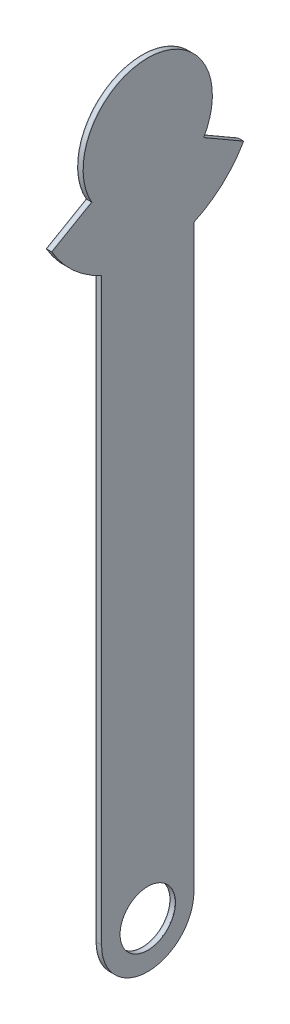
ISO-10303-21;
HEADER;
FILE_DESCRIPTION(('STEP AP214'),'2;1');
FILE_NAME('part.step','',(''),(''),'','','');
FILE_SCHEMA(('AUTOMOTIVE_DESIGN { 1 0 10303 214 1 1 1 1 }'));
ENDSEC;
DATA;
#1=APPLICATION_CONTEXT('core data for automotive mechanical design processes');
#2=APPLICATION_PROTOCOL_DEFINITION('international standard','automotive_design',2000,#1);
#3=PRODUCT_CONTEXT('',#1,'mechanical');
#4=PRODUCT('Part','Part','',(#3));
#5=PRODUCT_RELATED_PRODUCT_CATEGORY('part','',(#4));
#6=PRODUCT_DEFINITION_FORMATION('','',#4);
#7=PRODUCT_DEFINITION_CONTEXT('part definition',#1,'design');
#8=PRODUCT_DEFINITION('design','',#6,#7);
#9=PRODUCT_DEFINITION_SHAPE('','',#8);
#10=(LENGTH_UNIT() NAMED_UNIT(*) SI_UNIT(.MILLI.,.METRE.));
#11=(NAMED_UNIT(*) PLANE_ANGLE_UNIT() SI_UNIT($,.RADIAN.));
#12=(NAMED_UNIT(*) SI_UNIT($,.STERADIAN.) SOLID_ANGLE_UNIT());
#13=UNCERTAINTY_MEASURE_WITH_UNIT(LENGTH_MEASURE(1.E-05),#10,'distance_accuracy_value','');
#14=(GEOMETRIC_REPRESENTATION_CONTEXT(3) GLOBAL_UNCERTAINTY_ASSIGNED_CONTEXT((#13)) GLOBAL_UNIT_ASSIGNED_CONTEXT((#10,
#11,#12)) REPRESENTATION_CONTEXT('',''));
#15=CARTESIAN_POINT('',(0.,0.,0.));
#16=DIRECTION('',(0.,0.,1.));
#17=DIRECTION('',(1.,0.,0.));
#18=AXIS2_PLACEMENT_3D('',#15,#16,#17);
#19=CARTESIAN_POINT('',(-2.75,196.8,0.));
#20=DIRECTION('',(1.,0.,0.));
#21=DIRECTION('',(0.,0.,-1.));
#22=AXIS2_PLACEMENT_3D('',#19,#20,#21);
#23=CYLINDRICAL_SURFACE('',#22,60.);
#24=CARTESIAN_POINT('',(-2.5,196.8,0.));
#25=DIRECTION('',(-1.,0.,0.));
#26=DIRECTION('',(0.,0.,1.));
#27=AXIS2_PLACEMENT_3D('',#24,#25,#26);
#28=CIRCLE('',#27,60.);
#29=CARTESIAN_POINT('',(-2.5,142.256439426821,25.));
#30=VERTEX_POINT('',#29);
#31=CARTESIAN_POINT('',(-2.5,166.8,51.9615242270665));
#32=VERTEX_POINT('',#31);
#33=EDGE_CURVE('E165',#30,#32,#28,.T.);
#34=ORIENTED_EDGE('',*,*,#33,.T.);
#35=DIRECTION('',(1.,0.,0.));
#36=VECTOR('',#35,1.);
#37=CARTESIAN_POINT('',(-2.75,166.8,51.9615242270665));
#38=LINE('',#37,#36);
#39=CARTESIAN_POINT('',(-2.75,166.8,51.9615242270665));
#40=VERTEX_POINT('',#39);
#41=EDGE_CURVE('E12',#40,#32,#38,.T.);
#42=ORIENTED_EDGE('',*,*,#41,.F.);
#43=CARTESIAN_POINT('',(-2.75,196.8,0.));
#44=DIRECTION('',(-1.,0.,0.));
#45=DIRECTION('',(0.,0.,1.));
#46=AXIS2_PLACEMENT_3D('',#43,#44,#45);
#47=CIRCLE('',#46,60.);
#48=CARTESIAN_POINT('',(-2.75,142.256439426821,25.));
#49=VERTEX_POINT('',#48);
#50=EDGE_CURVE('E231',#49,#40,#47,.T.);
#51=ORIENTED_EDGE('',*,*,#50,.F.);
#52=DIRECTION('',(1.,0.,0.));
#53=VECTOR('',#52,1.);
#54=CARTESIAN_POINT('',(-2.75,142.256439426821,25.));
#55=LINE('',#54,#53);
#56=EDGE_CURVE('E157',#49,#30,#55,.T.);
#57=ORIENTED_EDGE('',*,*,#56,.T.);
#58=EDGE_LOOP('',(#34,#42,#51,#57));
#59=FACE_BOUND('',#58,.T.);
#60=ADVANCED_FACE('F58',(#59),#23,.T.);
#61=CARTESIAN_POINT('',(-2.75,147.600000000001,85.2168997323883));
#62=DIRECTION('',(0.,-0.866025403784441,-0.499999999999995));
#63=DIRECTION('',(0.,0.499999999999995,-0.866025403784442));
#64=AXIS2_PLACEMENT_3D('',#61,#62,#63);
#65=PLANE('',#64);
#66=DIRECTION('',(0.,0.499999999999995,-0.866025403784442));
#67=VECTOR('',#66,1.);
#68=CARTESIAN_POINT('',(-2.5,147.600000000001,85.2168997323883));
#69=LINE('',#68,#67);
#70=CARTESIAN_POINT('',(-2.5,179.3,30.3108891324555));
#71=VERTEX_POINT('',#70);
#72=EDGE_CURVE('E169',#32,#71,#69,.T.);
#73=ORIENTED_EDGE('',*,*,#72,.T.);
#74=DIRECTION('',(1.,0.,0.));
#75=VECTOR('',#74,1.);
#76=CARTESIAN_POINT('',(-2.75,179.3,30.3108891324555));
#77=LINE('',#76,#75);
#78=CARTESIAN_POINT('',(-2.75,179.3,30.3108891324555));
#79=VERTEX_POINT('',#78);
#80=EDGE_CURVE('E68',#79,#71,#77,.T.);
#81=ORIENTED_EDGE('',*,*,#80,.F.);
#82=DIRECTION('',(0.,0.499999999999995,-0.866025403784442));
#83=VECTOR('',#82,1.);
#84=CARTESIAN_POINT('',(-2.75,147.600000000001,85.2168997323883));
#85=LINE('',#84,#83);
#86=EDGE_CURVE('E119',#40,#79,#85,.T.);
#87=ORIENTED_EDGE('',*,*,#86,.F.);
#88=ORIENTED_EDGE('',*,*,#41,.T.);
#89=EDGE_LOOP('',(#73,#81,#87,#88));
#90=FACE_BOUND('',#89,.T.);
#91=ADVANCED_FACE('F253',(#90),#65,.F.);
#92=CARTESIAN_POINT('',(-2.75,196.8,0.));
#93=DIRECTION('',(1.,0.,0.));
#94=DIRECTION('',(0.,0.,-1.));
#95=AXIS2_PLACEMENT_3D('',#92,#93,#94);
#96=CYLINDRICAL_SURFACE('',#95,35.);
#97=CARTESIAN_POINT('',(-2.5,196.8,0.));
#98=DIRECTION('',(-1.,0.,0.));
#99=DIRECTION('',(0.,0.,1.));
#100=AXIS2_PLACEMENT_3D('',#97,#98,#99);
#101=CIRCLE('',#100,35.);
#102=CARTESIAN_POINT('',(-2.5,179.3,-30.3108891324553));
#103=VERTEX_POINT('',#102);
#104=EDGE_CURVE('E172',#71,#103,#101,.T.);
#105=ORIENTED_EDGE('',*,*,#104,.T.);
#106=DIRECTION('',(1.,0.,0.));
#107=VECTOR('',#106,1.);
#108=CARTESIAN_POINT('',(-2.75,179.3,-30.3108891324553));
#109=LINE('',#108,#107);
#110=CARTESIAN_POINT('',(-2.75,179.3,-30.3108891324553));
#111=VERTEX_POINT('',#110);
#112=EDGE_CURVE('E198',#111,#103,#109,.T.);
#113=ORIENTED_EDGE('',*,*,#112,.F.);
#114=CARTESIAN_POINT('',(-2.75,196.8,0.));
#115=DIRECTION('',(-1.,0.,0.));
#116=DIRECTION('',(0.,0.,1.));
#117=AXIS2_PLACEMENT_3D('',#114,#115,#116);
#118=CIRCLE('',#117,35.);
#119=EDGE_CURVE('E209',#79,#111,#118,.T.);
#120=ORIENTED_EDGE('',*,*,#119,.F.);
#121=ORIENTED_EDGE('',*,*,#80,.T.);
#122=EDGE_LOOP('',(#105,#113,#120,#121));
#123=FACE_BOUND('',#122,.T.);
#124=ADVANCED_FACE('F207',(#123),#96,.T.);
#125=CARTESIAN_POINT('',(-2.75,147.6,-85.2168997323889));
#126=DIRECTION('',(0.,-0.866025403784438,0.500000000000001));
#127=DIRECTION('',(0.,-0.500000000000001,-0.866025403784438));
#128=AXIS2_PLACEMENT_3D('',#125,#126,#127);
#129=PLANE('',#128);
#130=DIRECTION('',(0.,-0.500000000000001,-0.866025403784438));
#131=VECTOR('',#130,1.);
#132=CARTESIAN_POINT('',(-2.5,147.6,-85.2168997323889));
#133=LINE('',#132,#131);
#134=CARTESIAN_POINT('',(-2.5,166.8,-51.9615242270663));
#135=VERTEX_POINT('',#134);
#136=EDGE_CURVE('E175',#103,#135,#133,.T.);
#137=ORIENTED_EDGE('',*,*,#136,.T.);
#138=DIRECTION('',(1.,0.,0.));
#139=VECTOR('',#138,1.);
#140=CARTESIAN_POINT('',(-2.75,166.8,-51.9615242270663));
#141=LINE('',#140,#139);
#142=CARTESIAN_POINT('',(-2.75,166.8,-51.9615242270663));
#143=VERTEX_POINT('',#142);
#144=EDGE_CURVE('E194',#143,#135,#141,.T.);
#145=ORIENTED_EDGE('',*,*,#144,.F.);
#146=DIRECTION('',(0.,-0.500000000000001,-0.866025403784438));
#147=VECTOR('',#146,1.);
#148=CARTESIAN_POINT('',(-2.75,147.6,-85.2168997323889));
#149=LINE('',#148,#147);
#150=EDGE_CURVE('E222',#111,#143,#149,.T.);
#151=ORIENTED_EDGE('',*,*,#150,.F.);
#152=ORIENTED_EDGE('',*,*,#112,.T.);
#153=EDGE_LOOP('',(#137,#145,#151,#152));
#154=FACE_BOUND('',#153,.T.);
#155=ADVANCED_FACE('F217',(#154),#129,.F.);
#156=CARTESIAN_POINT('',(-2.75,196.8,0.));
#157=DIRECTION('',(1.,0.,0.));
#158=DIRECTION('',(0.,0.,-1.));
#159=AXIS2_PLACEMENT_3D('',#156,#157,#158);
#160=CYLINDRICAL_SURFACE('',#159,60.);
#161=CARTESIAN_POINT('',(-2.5,196.8,0.));
#162=DIRECTION('',(-1.,0.,0.));
#163=DIRECTION('',(0.,0.,1.));
#164=AXIS2_PLACEMENT_3D('',#161,#162,#163);
#165=CIRCLE('',#164,60.);
#166=CARTESIAN_POINT('',(-2.5,142.256439426821,-25.));
#167=VERTEX_POINT('',#166);
#168=EDGE_CURVE('E178',#135,#167,#165,.T.);
#169=ORIENTED_EDGE('',*,*,#168,.T.);
#170=DIRECTION('',(1.,0.,0.));
#171=VECTOR('',#170,1.);
#172=CARTESIAN_POINT('',(-2.75,142.256439426821,-25.));
#173=LINE('',#172,#171);
#174=CARTESIAN_POINT('',(-2.75,142.256439426821,-25.));
#175=VERTEX_POINT('',#174);
#176=EDGE_CURVE('E149',#175,#167,#173,.T.);
#177=ORIENTED_EDGE('',*,*,#176,.F.);
#178=CARTESIAN_POINT('',(-2.75,196.8,0.));
#179=DIRECTION('',(-1.,0.,0.));
#180=DIRECTION('',(0.,0.,1.));
#181=AXIS2_PLACEMENT_3D('',#178,#179,#180);
#182=CIRCLE('',#181,60.);
#183=EDGE_CURVE('E138',#143,#175,#182,.T.);
#184=ORIENTED_EDGE('',*,*,#183,.F.);
#185=ORIENTED_EDGE('',*,*,#144,.T.);
#186=EDGE_LOOP('',(#169,#177,#184,#185));
#187=FACE_BOUND('',#186,.T.);
#188=ADVANCED_FACE('F220',(#187),#160,.T.);
#189=CARTESIAN_POINT('',(-2.75,0.,-25.));
#190=DIRECTION('',(0.,0.,1.));
#191=DIRECTION('',(1.,0.,0.));
#192=AXIS2_PLACEMENT_3D('',#189,#190,#191);
#193=PLANE('',#192);
#194=DIRECTION('',(0.,-1.,0.));
#195=VECTOR('',#194,1.);
#196=CARTESIAN_POINT('',(-2.5,0.,-25.));
#197=LINE('',#196,#195);
#198=CARTESIAN_POINT('',(-2.5,-171.8,-25.));
#199=VERTEX_POINT('',#198);
#200=EDGE_CURVE('E147',#167,#199,#197,.T.);
#201=ORIENTED_EDGE('',*,*,#200,.T.);
#202=DIRECTION('',(1.,0.,0.));
#203=VECTOR('',#202,1.);
#204=CARTESIAN_POINT('',(-2.75,-171.8,-25.));
#205=LINE('',#204,#203);
#206=CARTESIAN_POINT('',(-2.75,-171.8,-25.));
#207=VERTEX_POINT('',#206);
#208=EDGE_CURVE('E144',#207,#199,#205,.T.);
#209=ORIENTED_EDGE('',*,*,#208,.F.);
#210=DIRECTION('',(0.,-1.,0.));
#211=VECTOR('',#210,1.);
#212=CARTESIAN_POINT('',(-2.75,0.,-25.));
#213=LINE('',#212,#211);
#214=EDGE_CURVE('E132',#175,#207,#213,.T.);
#215=ORIENTED_EDGE('',*,*,#214,.F.);
#216=ORIENTED_EDGE('',*,*,#176,.T.);
#217=EDGE_LOOP('',(#201,#209,#215,#216));
#218=FACE_BOUND('',#217,.T.);
#219=ADVANCED_FACE('F145',(#218),#193,.F.);
#220=CARTESIAN_POINT('',(-2.75,-171.8,0.));
#221=DIRECTION('',(1.,0.,0.));
#222=DIRECTION('',(0.,0.,-1.));
#223=AXIS2_PLACEMENT_3D('',#220,#221,#222);
#224=CYLINDRICAL_SURFACE('',#223,25.);
#225=CARTESIAN_POINT('',(-2.5,-171.8,0.));
#226=DIRECTION('',(-1.,0.,0.));
#227=DIRECTION('',(0.,0.,1.));
#228=AXIS2_PLACEMENT_3D('',#225,#226,#227);
#229=CIRCLE('',#228,25.);
#230=CARTESIAN_POINT('',(-2.5,-171.8,25.));
#231=VERTEX_POINT('',#230);
#232=EDGE_CURVE('E105',#199,#231,#229,.T.);
#233=ORIENTED_EDGE('',*,*,#232,.T.);
#234=DIRECTION('',(1.,0.,0.));
#235=VECTOR('',#234,1.);
#236=CARTESIAN_POINT('',(-2.75,-171.8,25.));
#237=LINE('',#236,#235);
#238=CARTESIAN_POINT('',(-2.75,-171.8,25.));
#239=VERTEX_POINT('',#238);
#240=EDGE_CURVE('E150',#239,#231,#237,.T.);
#241=ORIENTED_EDGE('',*,*,#240,.F.);
#242=CARTESIAN_POINT('',(-2.75,-171.8,0.));
#243=DIRECTION('',(-1.,0.,0.));
#244=DIRECTION('',(0.,0.,1.));
#245=AXIS2_PLACEMENT_3D('',#242,#243,#244);
#246=CIRCLE('',#245,25.);
#247=EDGE_CURVE('E136',#207,#239,#246,.T.);
#248=ORIENTED_EDGE('',*,*,#247,.F.);
#249=ORIENTED_EDGE('',*,*,#208,.T.);
#250=EDGE_LOOP('',(#233,#241,#248,#249));
#251=FACE_BOUND('',#250,.T.);
#252=ADVANCED_FACE('F152',(#251),#224,.T.);
#253=CARTESIAN_POINT('',(-2.75,-171.8,0.));
#254=DIRECTION('',(1.,0.,0.));
#255=DIRECTION('',(0.,0.,-1.));
#256=AXIS2_PLACEMENT_3D('',#253,#254,#255);
#257=CYLINDRICAL_SURFACE('',#256,15.);
#258=CARTESIAN_POINT('',(-2.75,-171.8,0.));
#259=DIRECTION('',(-1.,0.,0.));
#260=DIRECTION('',(0.,0.,1.));
#261=AXIS2_PLACEMENT_3D('',#258,#259,#260);
#262=CIRCLE('',#261,15.);
#263=CARTESIAN_POINT('',(-2.75,-171.8,15.));
#264=VERTEX_POINT('',#263);
#265=EDGE_CURVE('E187',#264,#264,#262,.F.);
#266=ORIENTED_EDGE('',*,*,#265,.F.);
#267=EDGE_LOOP('',(#266));
#268=FACE_BOUND('',#267,.T.);
#269=CARTESIAN_POINT('',(-2.5,-171.8,0.));
#270=DIRECTION('',(-1.,0.,0.));
#271=DIRECTION('',(0.,0.,1.));
#272=AXIS2_PLACEMENT_3D('',#269,#270,#271);
#273=CIRCLE('',#272,15.);
#274=CARTESIAN_POINT('',(-2.5,-171.8,15.));
#275=VERTEX_POINT('',#274);
#276=EDGE_CURVE('E161',#275,#275,#273,.F.);
#277=ORIENTED_EDGE('',*,*,#276,.T.);
#278=EDGE_LOOP('',(#277));
#279=FACE_BOUND('',#278,.T.);
#280=ADVANCED_FACE('F60',(#268,#279),#257,.F.);
#281=CARTESIAN_POINT('',(-2.75,0.,25.));
#282=DIRECTION('',(0.,0.,-1.));
#283=DIRECTION('',(-1.,0.,0.));
#284=AXIS2_PLACEMENT_3D('',#281,#282,#283);
#285=PLANE('',#284);
#286=DIRECTION('',(0.,1.,0.));
#287=VECTOR('',#286,1.);
#288=CARTESIAN_POINT('',(-2.5,0.,25.));
#289=LINE('',#288,#287);
#290=EDGE_CURVE('E111',#231,#30,#289,.T.);
#291=ORIENTED_EDGE('',*,*,#290,.T.);
#292=ORIENTED_EDGE('',*,*,#56,.F.);
#293=DIRECTION('',(0.,1.,0.));
#294=VECTOR('',#293,1.);
#295=CARTESIAN_POINT('',(-2.75,0.,25.));
#296=LINE('',#295,#294);
#297=EDGE_CURVE('E76',#239,#49,#296,.T.);
#298=ORIENTED_EDGE('',*,*,#297,.F.);
#299=ORIENTED_EDGE('',*,*,#240,.T.);
#300=EDGE_LOOP('',(#291,#292,#298,#299));
#301=FACE_BOUND('',#300,.T.);
#302=ADVANCED_FACE('F242',(#301),#285,.F.);
#303=CARTESIAN_POINT('',(-2.75,0.,0.));
#304=DIRECTION('',(-1.,0.,0.));
#305=DIRECTION('',(0.,0.,1.));
#306=AXIS2_PLACEMENT_3D('',#303,#304,#305);
#307=PLANE('',#306);
#308=ORIENTED_EDGE('',*,*,#265,.T.);
#309=EDGE_LOOP('',(#308));
#310=FACE_BOUND('',#309,.T.);
#311=ORIENTED_EDGE('',*,*,#50,.T.);
#312=ORIENTED_EDGE('',*,*,#86,.T.);
#313=ORIENTED_EDGE('',*,*,#119,.T.);
#314=ORIENTED_EDGE('',*,*,#150,.T.);
#315=ORIENTED_EDGE('',*,*,#183,.T.);
#316=ORIENTED_EDGE('',*,*,#214,.T.);
#317=ORIENTED_EDGE('',*,*,#247,.T.);
#318=ORIENTED_EDGE('',*,*,#297,.T.);
#319=EDGE_LOOP('',(#311,#312,#313,#314,#315,#316,#317,#318));
#320=FACE_BOUND('',#319,.T.);
#321=ADVANCED_FACE('F134',(#310,#320),#307,.T.);
#322=CARTESIAN_POINT('',(-2.5,0.,0.));
#323=DIRECTION('',(-1.,0.,0.));
#324=DIRECTION('',(0.,0.,1.));
#325=AXIS2_PLACEMENT_3D('',#322,#323,#324);
#326=PLANE('',#325);
#327=ORIENTED_EDGE('',*,*,#276,.F.);
#328=EDGE_LOOP('',(#327));
#329=FACE_BOUND('',#328,.T.);
#330=ORIENTED_EDGE('',*,*,#33,.F.);
#331=ORIENTED_EDGE('',*,*,#290,.F.);
#332=ORIENTED_EDGE('',*,*,#232,.F.);
#333=ORIENTED_EDGE('',*,*,#200,.F.);
#334=ORIENTED_EDGE('',*,*,#168,.F.);
#335=ORIENTED_EDGE('',*,*,#136,.F.);
#336=ORIENTED_EDGE('',*,*,#104,.F.);
#337=ORIENTED_EDGE('',*,*,#72,.F.);
#338=EDGE_LOOP('',(#330,#331,#332,#333,#334,#335,#336,#337));
#339=FACE_BOUND('',#338,.T.);
#340=ADVANCED_FACE('F213',(#329,#339),#326,.F.);
#341=CLOSED_SHELL('',(#60,#91,#124,#155,#188,#219,#252,#280,#302,#321,#340));
#342=MANIFOLD_SOLID_BREP('B2',#341);
#343=CARTESIAN_POINT('',(-2.5,147.600000000001,85.2168997323882));
#344=DIRECTION('',(0.,-0.866025403784442,-0.499999999999995));
#345=DIRECTION('',(0.,0.499999999999995,-0.866025403784442));
#346=AXIS2_PLACEMENT_3D('',#343,#344,#345);
#347=PLANE('',#346);
#348=DIRECTION('',(0.,0.499999999999995,-0.866025403784442));
#349=VECTOR('',#348,1.);
#350=CARTESIAN_POINT('',(0.,147.600000000001,85.2168997323882));
#351=LINE('',#350,#349);
#352=CARTESIAN_POINT('',(0.,166.8,51.9615242270665));
#353=VERTEX_POINT('',#352);
#354=CARTESIAN_POINT('',(0.,179.3,30.3108891324555));
#355=VERTEX_POINT('',#354);
#356=EDGE_CURVE('E478',#353,#355,#351,.T.);
#357=ORIENTED_EDGE('',*,*,#356,.T.);
#358=DIRECTION('',(1.,0.,0.));
#359=VECTOR('',#358,1.);
#360=CARTESIAN_POINT('',(-2.5,179.3,30.3108891324555));
#361=LINE('',#360,#359);
#362=CARTESIAN_POINT('',(-2.5,179.3,30.3108891324555));
#363=VERTEX_POINT('',#362);
#364=EDGE_CURVE('E56',#363,#355,#361,.T.);
#365=ORIENTED_EDGE('',*,*,#364,.F.);
#366=DIRECTION('',(0.,0.499999999999995,-0.866025403784442));
#367=VECTOR('',#366,1.);
#368=CARTESIAN_POINT('',(-2.5,147.600000000001,85.2168997323882));
#369=LINE('',#368,#367);
#370=CARTESIAN_POINT('',(-2.5,166.8,51.9615242270665));
#371=VERTEX_POINT('',#370);
#372=EDGE_CURVE('E504',#371,#363,#369,.T.);
#373=ORIENTED_EDGE('',*,*,#372,.F.);
#374=DIRECTION('',(1.,0.,0.));
#375=VECTOR('',#374,1.);
#376=CARTESIAN_POINT('',(-2.5,166.8,51.9615242270665));
#377=LINE('',#376,#375);
#378=EDGE_CURVE('E477',#371,#353,#377,.T.);
#379=ORIENTED_EDGE('',*,*,#378,.T.);
#380=EDGE_LOOP('',(#357,#365,#373,#379));
#381=FACE_BOUND('',#380,.T.);
#382=ADVANCED_FACE('F371',(#381),#347,.F.);
#383=CARTESIAN_POINT('',(-2.5,196.8,0.));
#384=DIRECTION('',(1.,0.,0.));
#385=DIRECTION('',(0.,0.,-1.));
#386=AXIS2_PLACEMENT_3D('',#383,#384,#385);
#387=CYLINDRICAL_SURFACE('',#386,35.);
#388=CARTESIAN_POINT('',(0.,196.8,0.));
#389=DIRECTION('',(-1.,0.,0.));
#390=DIRECTION('',(0.,0.,1.));
#391=AXIS2_PLACEMENT_3D('',#388,#389,#390);
#392=CIRCLE('',#391,35.);
#393=CARTESIAN_POINT('',(0.,179.3,-30.3108891324553));
#394=VERTEX_POINT('',#393);
#395=EDGE_CURVE('E482',#355,#394,#392,.T.);
#396=ORIENTED_EDGE('',*,*,#395,.T.);
#397=DIRECTION('',(1.,0.,0.));
#398=VECTOR('',#397,1.);
#399=CARTESIAN_POINT('',(-2.5,179.3,-30.3108891324553));
#400=LINE('',#399,#398);
#401=CARTESIAN_POINT('',(-2.5,179.3,-30.3108891324553));
#402=VERTEX_POINT('',#401);
#403=EDGE_CURVE('E380',#402,#394,#400,.T.);
#404=ORIENTED_EDGE('',*,*,#403,.F.);
#405=CARTESIAN_POINT('',(-2.5,196.8,0.));
#406=DIRECTION('',(-1.,0.,0.));
#407=DIRECTION('',(0.,0.,1.));
#408=AXIS2_PLACEMENT_3D('',#405,#406,#407);
#409=CIRCLE('',#408,35.);
#410=EDGE_CURVE('E431',#363,#402,#409,.T.);
#411=ORIENTED_EDGE('',*,*,#410,.F.);
#412=ORIENTED_EDGE('',*,*,#364,.T.);
#413=EDGE_LOOP('',(#396,#404,#411,#412));
#414=FACE_BOUND('',#413,.T.);
#415=ADVANCED_FACE('F554',(#414),#387,.T.);
#416=CARTESIAN_POINT('',(-2.5,147.6,-85.2168997323889));
#417=DIRECTION('',(0.,-0.866025403784438,0.500000000000001));
#418=DIRECTION('',(0.,-0.500000000000001,-0.866025403784438));
#419=AXIS2_PLACEMENT_3D('',#416,#417,#418);
#420=PLANE('',#419);
#421=DIRECTION('',(0.,-0.500000000000001,-0.866025403784438));
#422=VECTOR('',#421,1.);
#423=CARTESIAN_POINT('',(0.,147.6,-85.2168997323889));
#424=LINE('',#423,#422);
#425=CARTESIAN_POINT('',(0.,166.8,-51.9615242270663));
#426=VERTEX_POINT('',#425);
#427=EDGE_CURVE('E485',#394,#426,#424,.T.);
#428=ORIENTED_EDGE('',*,*,#427,.T.);
#429=DIRECTION('',(1.,0.,0.));
#430=VECTOR('',#429,1.);
#431=CARTESIAN_POINT('',(-2.5,166.8,-51.9615242270663));
#432=LINE('',#431,#430);
#433=CARTESIAN_POINT('',(-2.5,166.8,-51.9615242270663));
#434=VERTEX_POINT('',#433);
#435=EDGE_CURVE('E515',#434,#426,#432,.T.);
#436=ORIENTED_EDGE('',*,*,#435,.F.);
#437=DIRECTION('',(0.,-0.500000000000001,-0.866025403784438));
#438=VECTOR('',#437,1.);
#439=CARTESIAN_POINT('',(-2.5,147.6,-85.2168997323889));
#440=LINE('',#439,#438);
#441=EDGE_CURVE('E526',#402,#434,#440,.T.);
#442=ORIENTED_EDGE('',*,*,#441,.F.);
#443=ORIENTED_EDGE('',*,*,#403,.T.);
#444=EDGE_LOOP('',(#428,#436,#442,#443));
#445=FACE_BOUND('',#444,.T.);
#446=ADVANCED_FACE('F524',(#445),#420,.F.);
#447=CARTESIAN_POINT('',(-2.5,196.8,0.));
#448=DIRECTION('',(1.,0.,0.));
#449=DIRECTION('',(0.,0.,-1.));
#450=AXIS2_PLACEMENT_3D('',#447,#448,#449);
#451=CYLINDRICAL_SURFACE('',#450,60.);
#452=CARTESIAN_POINT('',(0.,196.8,0.));
#453=DIRECTION('',(-1.,0.,0.));
#454=DIRECTION('',(0.,0.,1.));
#455=AXIS2_PLACEMENT_3D('',#452,#453,#454);
#456=CIRCLE('',#455,60.);
#457=CARTESIAN_POINT('',(0.,142.256439426821,-25.));
#458=VERTEX_POINT('',#457);
#459=EDGE_CURVE('E488',#426,#458,#456,.T.);
#460=ORIENTED_EDGE('',*,*,#459,.T.);
#461=DIRECTION('',(1.,0.,0.));
#462=VECTOR('',#461,1.);
#463=CARTESIAN_POINT('',(-2.5,142.256439426821,-25.));
#464=LINE('',#463,#462);
#465=CARTESIAN_POINT('',(-2.5,142.256439426821,-25.));
#466=VERTEX_POINT('',#465);
#467=EDGE_CURVE('E511',#466,#458,#464,.T.);
#468=ORIENTED_EDGE('',*,*,#467,.F.);
#469=CARTESIAN_POINT('',(-2.5,196.8,0.));
#470=DIRECTION('',(-1.,0.,0.));
#471=DIRECTION('',(0.,0.,1.));
#472=AXIS2_PLACEMENT_3D('',#469,#470,#471);
#473=CIRCLE('',#472,60.);
#474=EDGE_CURVE('E540',#434,#466,#473,.T.);
#475=ORIENTED_EDGE('',*,*,#474,.F.);
#476=ORIENTED_EDGE('',*,*,#435,.T.);
#477=EDGE_LOOP('',(#460,#468,#475,#476));
#478=FACE_BOUND('',#477,.T.);
#479=ADVANCED_FACE('F535',(#478),#451,.T.);
#480=CARTESIAN_POINT('',(-2.5,0.,-25.));
#481=DIRECTION('',(0.,0.,1.));
#482=DIRECTION('',(1.,0.,0.));
#483=AXIS2_PLACEMENT_3D('',#480,#481,#482);
#484=PLANE('',#483);
#485=DIRECTION('',(0.,-1.,0.));
#486=VECTOR('',#485,1.);
#487=CARTESIAN_POINT('',(0.,0.,-25.));
#488=LINE('',#487,#486);
#489=CARTESIAN_POINT('',(0.,-171.8,-25.));
#490=VERTEX_POINT('',#489);
#491=EDGE_CURVE('E491',#458,#490,#488,.T.);
#492=ORIENTED_EDGE('',*,*,#491,.T.);
#493=DIRECTION('',(1.,0.,0.));
#494=VECTOR('',#493,1.);
#495=CARTESIAN_POINT('',(-2.5,-171.8,-25.));
#496=LINE('',#495,#494);
#497=CARTESIAN_POINT('',(-2.5,-171.8,-25.));
#498=VERTEX_POINT('',#497);
#499=EDGE_CURVE('E462',#498,#490,#496,.T.);
#500=ORIENTED_EDGE('',*,*,#499,.F.);
#501=DIRECTION('',(0.,-1.,0.));
#502=VECTOR('',#501,1.);
#503=CARTESIAN_POINT('',(-2.5,0.,-25.));
#504=LINE('',#503,#502);
#505=EDGE_CURVE('E451',#466,#498,#504,.T.);
#506=ORIENTED_EDGE('',*,*,#505,.F.);
#507=ORIENTED_EDGE('',*,*,#467,.T.);
#508=EDGE_LOOP('',(#492,#500,#506,#507));
#509=FACE_BOUND('',#508,.T.);
#510=ADVANCED_FACE('F538',(#509),#484,.F.);
#511=CARTESIAN_POINT('',(-2.5,-171.8,0.));
#512=DIRECTION('',(1.,0.,0.));
#513=DIRECTION('',(0.,0.,-1.));
#514=AXIS2_PLACEMENT_3D('',#511,#512,#513);
#515=CYLINDRICAL_SURFACE('',#514,25.);
#516=CARTESIAN_POINT('',(0.,-171.8,0.));
#517=DIRECTION('',(-1.,0.,0.));
#518=DIRECTION('',(0.,0.,1.));
#519=AXIS2_PLACEMENT_3D('',#516,#517,#518);
#520=CIRCLE('',#519,25.);
#521=CARTESIAN_POINT('',(0.,-171.8,25.));
#522=VERTEX_POINT('',#521);
#523=EDGE_CURVE('E460',#490,#522,#520,.T.);
#524=ORIENTED_EDGE('',*,*,#523,.T.);
#525=DIRECTION('',(1.,0.,0.));
#526=VECTOR('',#525,1.);
#527=CARTESIAN_POINT('',(-2.5,-171.8,25.));
#528=LINE('',#527,#526);
#529=CARTESIAN_POINT('',(-2.5,-171.8,25.));
#530=VERTEX_POINT('',#529);
#531=EDGE_CURVE('E457',#530,#522,#528,.T.);
#532=ORIENTED_EDGE('',*,*,#531,.F.);
#533=CARTESIAN_POINT('',(-2.5,-171.8,0.));
#534=DIRECTION('',(-1.,0.,0.));
#535=DIRECTION('',(0.,0.,1.));
#536=AXIS2_PLACEMENT_3D('',#533,#534,#535);
#537=CIRCLE('',#536,25.);
#538=EDGE_CURVE('E444',#498,#530,#537,.T.);
#539=ORIENTED_EDGE('',*,*,#538,.F.);
#540=ORIENTED_EDGE('',*,*,#499,.T.);
#541=EDGE_LOOP('',(#524,#532,#539,#540));
#542=FACE_BOUND('',#541,.T.);
#543=ADVANCED_FACE('F458',(#542),#515,.T.);
#544=CARTESIAN_POINT('',(-2.5,0.,25.));
#545=DIRECTION('',(0.,0.,-1.));
#546=DIRECTION('',(-1.,0.,0.));
#547=AXIS2_PLACEMENT_3D('',#544,#545,#546);
#548=PLANE('',#547);
#549=DIRECTION('',(0.,1.,0.));
#550=VECTOR('',#549,1.);
#551=CARTESIAN_POINT('',(0.,0.,25.));
#552=LINE('',#551,#550);
#553=CARTESIAN_POINT('',(0.,142.256439426821,25.));
#554=VERTEX_POINT('',#553);
#555=EDGE_CURVE('E417',#522,#554,#552,.T.);
#556=ORIENTED_EDGE('',*,*,#555,.T.);
#557=DIRECTION('',(1.,0.,0.));
#558=VECTOR('',#557,1.);
#559=CARTESIAN_POINT('',(-2.5,142.256439426821,25.));
#560=LINE('',#559,#558);
#561=CARTESIAN_POINT('',(-2.5,142.256439426821,25.));
#562=VERTEX_POINT('',#561);
#563=EDGE_CURVE('E463',#562,#554,#560,.T.);
#564=ORIENTED_EDGE('',*,*,#563,.F.);
#565=DIRECTION('',(0.,1.,0.));
#566=VECTOR('',#565,1.);
#567=CARTESIAN_POINT('',(-2.5,0.,25.));
#568=LINE('',#567,#566);
#569=EDGE_CURVE('E449',#530,#562,#568,.T.);
#570=ORIENTED_EDGE('',*,*,#569,.F.);
#571=ORIENTED_EDGE('',*,*,#531,.T.);
#572=EDGE_LOOP('',(#556,#564,#570,#571));
#573=FACE_BOUND('',#572,.T.);
#574=ADVANCED_FACE('F465',(#573),#548,.F.);
#575=CARTESIAN_POINT('',(-2.5,196.8,0.));
#576=DIRECTION('',(1.,0.,0.));
#577=DIRECTION('',(0.,0.,-1.));
#578=AXIS2_PLACEMENT_3D('',#575,#576,#577);
#579=CYLINDRICAL_SURFACE('',#578,60.);
#580=CARTESIAN_POINT('',(0.,196.8,0.));
#581=DIRECTION('',(-1.,0.,0.));
#582=DIRECTION('',(0.,0.,1.));
#583=AXIS2_PLACEMENT_3D('',#580,#581,#582);
#584=CIRCLE('',#583,60.);
#585=EDGE_CURVE('E423',#554,#353,#584,.T.);
#586=ORIENTED_EDGE('',*,*,#585,.T.);
#587=ORIENTED_EDGE('',*,*,#378,.F.);
#588=CARTESIAN_POINT('',(-2.5,196.8,0.));
#589=DIRECTION('',(-1.,0.,0.));
#590=DIRECTION('',(0.,0.,1.));
#591=AXIS2_PLACEMENT_3D('',#588,#589,#590);
#592=CIRCLE('',#591,60.);
#593=EDGE_CURVE('E388',#562,#371,#592,.T.);
#594=ORIENTED_EDGE('',*,*,#593,.F.);
#595=ORIENTED_EDGE('',*,*,#563,.T.);
#596=EDGE_LOOP('',(#586,#587,#594,#595));
#597=FACE_BOUND('',#596,.T.);
#598=ADVANCED_FACE('F570',(#597),#579,.T.);
#599=CARTESIAN_POINT('',(-2.5,-171.8,0.));
#600=DIRECTION('',(1.,0.,0.));
#601=DIRECTION('',(0.,0.,-1.));
#602=AXIS2_PLACEMENT_3D('',#599,#600,#601);
#603=CYLINDRICAL_SURFACE('',#602,15.);
#604=CARTESIAN_POINT('',(-2.5,-171.8,0.));
#605=DIRECTION('',(-1.,0.,0.));
#606=DIRECTION('',(0.,0.,1.));
#607=AXIS2_PLACEMENT_3D('',#604,#605,#606);
#608=CIRCLE('',#607,15.);
#609=CARTESIAN_POINT('',(-2.5,-171.8,15.));
#610=VERTEX_POINT('',#609);
#611=EDGE_CURVE('E470',#610,#610,#608,.F.);
#612=ORIENTED_EDGE('',*,*,#611,.F.);
#613=EDGE_LOOP('',(#612));
#614=FACE_BOUND('',#613,.T.);
#615=CARTESIAN_POINT('',(0.,-171.8,0.));
#616=DIRECTION('',(-1.,0.,0.));
#617=DIRECTION('',(0.,0.,1.));
#618=AXIS2_PLACEMENT_3D('',#615,#616,#617);
#619=CIRCLE('',#618,15.);
#620=CARTESIAN_POINT('',(0.,-171.8,15.));
#621=VERTEX_POINT('',#620);
#622=EDGE_CURVE('E500',#621,#621,#619,.F.);
#623=ORIENTED_EDGE('',*,*,#622,.T.);
#624=EDGE_LOOP('',(#623));
#625=FACE_BOUND('',#624,.T.);
#626=ADVANCED_FACE('F573',(#614,#625),#603,.F.);
#627=CARTESIAN_POINT('',(-2.5,0.,0.));
#628=DIRECTION('',(-1.,0.,0.));
#629=DIRECTION('',(0.,0.,1.));
#630=AXIS2_PLACEMENT_3D('',#627,#628,#629);
#631=PLANE('',#630);
#632=ORIENTED_EDGE('',*,*,#372,.T.);
#633=ORIENTED_EDGE('',*,*,#410,.T.);
#634=ORIENTED_EDGE('',*,*,#441,.T.);
#635=ORIENTED_EDGE('',*,*,#474,.T.);
#636=ORIENTED_EDGE('',*,*,#505,.T.);
#637=ORIENTED_EDGE('',*,*,#538,.T.);
#638=ORIENTED_EDGE('',*,*,#569,.T.);
#639=ORIENTED_EDGE('',*,*,#593,.T.);
#640=EDGE_LOOP('',(#632,#633,#634,#635,#636,#637,#638,#639));
#641=FACE_BOUND('',#640,.T.);
#642=ORIENTED_EDGE('',*,*,#611,.T.);
#643=EDGE_LOOP('',(#642));
#644=FACE_BOUND('',#643,.T.);
#645=ADVANCED_FACE('F446',(#641,#644),#631,.T.);
#646=CARTESIAN_POINT('',(0.,0.,0.));
#647=DIRECTION('',(-1.,0.,0.));
#648=DIRECTION('',(0.,0.,1.));
#649=AXIS2_PLACEMENT_3D('',#646,#647,#648);
#650=PLANE('',#649);
#651=ORIENTED_EDGE('',*,*,#356,.F.);
#652=ORIENTED_EDGE('',*,*,#585,.F.);
#653=ORIENTED_EDGE('',*,*,#555,.F.);
#654=ORIENTED_EDGE('',*,*,#523,.F.);
#655=ORIENTED_EDGE('',*,*,#491,.F.);
#656=ORIENTED_EDGE('',*,*,#459,.F.);
#657=ORIENTED_EDGE('',*,*,#427,.F.);
#658=ORIENTED_EDGE('',*,*,#395,.F.);
#659=EDGE_LOOP('',(#651,#652,#653,#654,#655,#656,#657,#658));
#660=FACE_BOUND('',#659,.T.);
#661=ORIENTED_EDGE('',*,*,#622,.F.);
#662=EDGE_LOOP('',(#661));
#663=FACE_BOUND('',#662,.T.);
#664=ADVANCED_FACE('F530',(#660,#663),#650,.F.);
#665=CLOSED_SHELL('',(#382,#415,#446,#479,#510,#543,#574,#598,#626,#645,#664));
#666=MANIFOLD_SOLID_BREP('B6',#665);
#667=CARTESIAN_POINT('',(0.25,196.8,0.));
#668=DIRECTION('',(-1.,0.,0.));
#669=DIRECTION('',(0.,0.,1.));
#670=AXIS2_PLACEMENT_3D('',#667,#668,#669);
#671=CYLINDRICAL_SURFACE('',#670,35.);
#672=CARTESIAN_POINT('',(0.,196.8,0.));
#673=DIRECTION('',(1.,0.,0.));
#674=DIRECTION('',(0.,0.,-1.));
#675=AXIS2_PLACEMENT_3D('',#672,#673,#674);
#676=CIRCLE('',#675,35.);
#677=CARTESIAN_POINT('',(0.,179.3,-30.3108891324553));
#678=VERTEX_POINT('',#677);
#679=CARTESIAN_POINT('',(0.,179.3,30.3108891324555));
#680=VERTEX_POINT('',#679);
#681=EDGE_CURVE('E785',#678,#680,#676,.T.);
#682=ORIENTED_EDGE('',*,*,#681,.T.);
#683=DIRECTION('',(-1.,0.,0.));
#684=VECTOR('',#683,1.);
#685=CARTESIAN_POINT('',(0.25,179.3,30.3108891324555));
#686=LINE('',#685,#684);
#687=CARTESIAN_POINT('',(0.25,179.3,30.3108891324555));
#688=VERTEX_POINT('',#687);
#689=EDGE_CURVE('E369',#688,#680,#686,.T.);
#690=ORIENTED_EDGE('',*,*,#689,.F.);
#691=CARTESIAN_POINT('',(0.25,196.8,0.));
#692=DIRECTION('',(1.,0.,0.));
#693=DIRECTION('',(0.,0.,-1.));
#694=AXIS2_PLACEMENT_3D('',#691,#692,#693);
#695=CIRCLE('',#694,35.);
#696=CARTESIAN_POINT('',(0.25,179.3,-30.3108891324553));
#697=VERTEX_POINT('',#696);
#698=EDGE_CURVE('E961',#697,#688,#695,.T.);
#699=ORIENTED_EDGE('',*,*,#698,.F.);
#700=DIRECTION('',(-1.,0.,0.));
#701=VECTOR('',#700,1.);
#702=CARTESIAN_POINT('',(0.25,179.3,-30.3108891324553));
#703=LINE('',#702,#701);
#704=EDGE_CURVE('E693',#697,#678,#703,.T.);
#705=ORIENTED_EDGE('',*,*,#704,.T.);
#706=EDGE_LOOP('',(#682,#690,#699,#705));
#707=FACE_BOUND('',#706,.T.);
#708=ADVANCED_FACE('F675',(#707),#671,.T.);
#709=CARTESIAN_POINT('',(0.25,147.600000000001,85.2168997323882));
#710=DIRECTION('',(0.,-0.866025403784441,-0.499999999999995));
#711=DIRECTION('',(0.,0.499999999999995,-0.866025403784442));
#712=AXIS2_PLACEMENT_3D('',#709,#710,#711);
#713=PLANE('',#712);
#714=DIRECTION('',(0.,-0.499999999999995,0.866025403784442));
#715=VECTOR('',#714,1.);
#716=CARTESIAN_POINT('',(0.,147.600000000001,85.2168997323882));
#717=LINE('',#716,#715);
#718=CARTESIAN_POINT('',(0.,166.8,51.9615242270666));
#719=VERTEX_POINT('',#718);
#720=EDGE_CURVE('E788',#680,#719,#717,.T.);
#721=ORIENTED_EDGE('',*,*,#720,.T.);
#722=DIRECTION('',(-1.,0.,0.));
#723=VECTOR('',#722,1.);
#724=CARTESIAN_POINT('',(0.25,166.8,51.9615242270666));
#725=LINE('',#724,#723);
#726=CARTESIAN_POINT('',(0.25,166.8,51.9615242270666));
#727=VERTEX_POINT('',#726);
#728=EDGE_CURVE('E685',#727,#719,#725,.T.);
#729=ORIENTED_EDGE('',*,*,#728,.F.);
#730=DIRECTION('',(0.,-0.499999999999995,0.866025403784442));
#731=VECTOR('',#730,1.);
#732=CARTESIAN_POINT('',(0.25,147.600000000001,85.2168997323882));
#733=LINE('',#732,#731);
#734=EDGE_CURVE('E732',#688,#727,#733,.T.);
#735=ORIENTED_EDGE('',*,*,#734,.F.);
#736=ORIENTED_EDGE('',*,*,#689,.T.);
#737=EDGE_LOOP('',(#721,#729,#735,#736));
#738=FACE_BOUND('',#737,.T.);
#739=ADVANCED_FACE('F856',(#738),#713,.F.);
#740=CARTESIAN_POINT('',(0.25,196.8,0.));
#741=DIRECTION('',(-1.,0.,0.));
#742=DIRECTION('',(0.,0.,1.));
#743=AXIS2_PLACEMENT_3D('',#740,#741,#742);
#744=CYLINDRICAL_SURFACE('',#743,60.);
#745=CARTESIAN_POINT('',(0.,196.8,0.));
#746=DIRECTION('',(1.,0.,0.));
#747=DIRECTION('',(0.,0.,-1.));
#748=AXIS2_PLACEMENT_3D('',#745,#746,#747);
#749=CIRCLE('',#748,60.);
#750=CARTESIAN_POINT('',(0.,142.256439426821,25.));
#751=VERTEX_POINT('',#750);
#752=EDGE_CURVE('E791',#719,#751,#749,.T.);
#753=ORIENTED_EDGE('',*,*,#752,.T.);
#754=DIRECTION('',(-1.,0.,0.));
#755=VECTOR('',#754,1.);
#756=CARTESIAN_POINT('',(0.25,142.256439426821,25.));
#757=LINE('',#756,#755);
#758=CARTESIAN_POINT('',(0.25,142.256439426821,25.));
#759=VERTEX_POINT('',#758);
#760=EDGE_CURVE('E821',#759,#751,#757,.T.);
#761=ORIENTED_EDGE('',*,*,#760,.F.);
#762=CARTESIAN_POINT('',(0.25,196.8,0.));
#763=DIRECTION('',(1.,0.,0.));
#764=DIRECTION('',(0.,0.,-1.));
#765=AXIS2_PLACEMENT_3D('',#762,#763,#764);
#766=CIRCLE('',#765,60.);
#767=EDGE_CURVE('E832',#727,#759,#766,.T.);
#768=ORIENTED_EDGE('',*,*,#767,.F.);
#769=ORIENTED_EDGE('',*,*,#728,.T.);
#770=EDGE_LOOP('',(#753,#761,#768,#769));
#771=FACE_BOUND('',#770,.T.);
#772=ADVANCED_FACE('F830',(#771),#744,.T.);
#773=CARTESIAN_POINT('',(0.25,0.,25.));
#774=DIRECTION('',(0.,0.,-1.));
#775=DIRECTION('',(-1.,0.,0.));
#776=AXIS2_PLACEMENT_3D('',#773,#774,#775);
#777=PLANE('',#776);
#778=DIRECTION('',(0.,-1.,0.));
#779=VECTOR('',#778,1.);
#780=CARTESIAN_POINT('',(0.,0.,25.));
#781=LINE('',#780,#779);
#782=CARTESIAN_POINT('',(0.,-171.8,25.));
#783=VERTEX_POINT('',#782);
#784=EDGE_CURVE('E794',#751,#783,#781,.T.);
#785=ORIENTED_EDGE('',*,*,#784,.T.);
#786=DIRECTION('',(-1.,0.,0.));
#787=VECTOR('',#786,1.);
#788=CARTESIAN_POINT('',(0.25,-171.8,25.));
#789=LINE('',#788,#787);
#790=CARTESIAN_POINT('',(0.25,-171.8,25.));
#791=VERTEX_POINT('',#790);
#792=EDGE_CURVE('E817',#791,#783,#789,.T.);
#793=ORIENTED_EDGE('',*,*,#792,.F.);
#794=DIRECTION('',(0.,-1.,0.));
#795=VECTOR('',#794,1.);
#796=CARTESIAN_POINT('',(0.25,0.,25.));
#797=LINE('',#796,#795);
#798=EDGE_CURVE('E775',#759,#791,#797,.T.);
#799=ORIENTED_EDGE('',*,*,#798,.F.);
#800=ORIENTED_EDGE('',*,*,#760,.T.);
#801=EDGE_LOOP('',(#785,#793,#799,#800));
#802=FACE_BOUND('',#801,.T.);
#803=ADVANCED_FACE('F839',(#802),#777,.F.);
#804=CARTESIAN_POINT('',(0.25,-171.8,0.));
#805=DIRECTION('',(-1.,0.,0.));
#806=DIRECTION('',(0.,0.,1.));
#807=AXIS2_PLACEMENT_3D('',#804,#805,#806);
#808=CYLINDRICAL_SURFACE('',#807,25.);
#809=CARTESIAN_POINT('',(0.,-171.8,0.));
#810=DIRECTION('',(1.,0.,0.));
#811=DIRECTION('',(0.,0.,-1.));
#812=AXIS2_PLACEMENT_3D('',#809,#810,#811);
#813=CIRCLE('',#812,25.);
#814=CARTESIAN_POINT('',(0.,-171.8,-25.));
#815=VERTEX_POINT('',#814);
#816=EDGE_CURVE('E797',#783,#815,#813,.T.);
#817=ORIENTED_EDGE('',*,*,#816,.T.);
#818=DIRECTION('',(-1.,0.,0.));
#819=VECTOR('',#818,1.);
#820=CARTESIAN_POINT('',(0.25,-171.8,-25.));
#821=LINE('',#820,#819);
#822=CARTESIAN_POINT('',(0.25,-171.8,-25.));
#823=VERTEX_POINT('',#822);
#824=EDGE_CURVE('E758',#823,#815,#821,.T.);
#825=ORIENTED_EDGE('',*,*,#824,.F.);
#826=CARTESIAN_POINT('',(0.25,-171.8,0.));
#827=DIRECTION('',(1.,0.,0.));
#828=DIRECTION('',(0.,0.,-1.));
#829=AXIS2_PLACEMENT_3D('',#826,#827,#828);
#830=CIRCLE('',#829,25.);
#831=EDGE_CURVE('E769',#791,#823,#830,.T.);
#832=ORIENTED_EDGE('',*,*,#831,.F.);
#833=ORIENTED_EDGE('',*,*,#792,.T.);
#834=EDGE_LOOP('',(#817,#825,#832,#833));
#835=FACE_BOUND('',#834,.T.);
#836=ADVANCED_FACE('F842',(#835),#808,.T.);
#837=CARTESIAN_POINT('',(0.25,0.,-25.));
#838=DIRECTION('',(0.,0.,-1.));
#839=DIRECTION('',(-1.,0.,0.));
#840=AXIS2_PLACEMENT_3D('',#837,#838,#839);
#841=PLANE('',#840);
#842=DIRECTION('',(0.,-1.,0.));
#843=VECTOR('',#842,1.);
#844=CARTESIAN_POINT('',(0.,0.,-25.));
#845=LINE('',#844,#843);
#846=CARTESIAN_POINT('',(0.,142.256439426821,-25.));
#847=VERTEX_POINT('',#846);
#848=EDGE_CURVE('E754',#847,#815,#845,.T.);
#849=ORIENTED_EDGE('',*,*,#848,.F.);
#850=DIRECTION('',(-1.,0.,0.));
#851=VECTOR('',#850,1.);
#852=CARTESIAN_POINT('',(0.25,142.256439426821,-25.));
#853=LINE('',#852,#851);
#854=CARTESIAN_POINT('',(0.25,142.256439426821,-25.));
#855=VERTEX_POINT('',#854);
#856=EDGE_CURVE('E748',#855,#847,#853,.T.);
#857=ORIENTED_EDGE('',*,*,#856,.F.);
#858=DIRECTION('',(0.,-1.,0.));
#859=VECTOR('',#858,1.);
#860=CARTESIAN_POINT('',(0.25,0.,-25.));
#861=LINE('',#860,#859);
#862=EDGE_CURVE('E752',#855,#823,#861,.T.);
#863=ORIENTED_EDGE('',*,*,#862,.T.);
#864=ORIENTED_EDGE('',*,*,#824,.T.);
#865=EDGE_LOOP('',(#849,#857,#863,#864));
#866=FACE_BOUND('',#865,.T.);
#867=ADVANCED_FACE('F750',(#866),#841,.T.);
#868=CARTESIAN_POINT('',(0.25,196.8,0.));
#869=DIRECTION('',(-1.,0.,0.));
#870=DIRECTION('',(0.,0.,1.));
#871=AXIS2_PLACEMENT_3D('',#868,#869,#870);
#872=CYLINDRICAL_SURFACE('',#871,60.);
#873=CARTESIAN_POINT('',(0.,196.8,0.));
#874=DIRECTION('',(1.,0.,0.));
#875=DIRECTION('',(0.,0.,-1.));
#876=AXIS2_PLACEMENT_3D('',#873,#874,#875);
#877=CIRCLE('',#876,60.);
#878=CARTESIAN_POINT('',(0.,166.8,-51.9615242270662));
#879=VERTEX_POINT('',#878);
#880=EDGE_CURVE('E803',#847,#879,#877,.T.);
#881=ORIENTED_EDGE('',*,*,#880,.T.);
#882=DIRECTION('',(-1.,0.,0.));
#883=VECTOR('',#882,1.);
#884=CARTESIAN_POINT('',(0.25,166.8,-51.9615242270662));
#885=LINE('',#884,#883);
#886=CARTESIAN_POINT('',(0.25,166.8,-51.9615242270662));
#887=VERTEX_POINT('',#886);
#888=EDGE_CURVE('E720',#887,#879,#885,.T.);
#889=ORIENTED_EDGE('',*,*,#888,.F.);
#890=CARTESIAN_POINT('',(0.25,196.8,0.));
#891=DIRECTION('',(1.,0.,0.));
#892=DIRECTION('',(0.,0.,-1.));
#893=AXIS2_PLACEMENT_3D('',#890,#891,#892);
#894=CIRCLE('',#893,60.);
#895=EDGE_CURVE('E760',#855,#887,#894,.T.);
#896=ORIENTED_EDGE('',*,*,#895,.F.);
#897=ORIENTED_EDGE('',*,*,#856,.T.);
#898=EDGE_LOOP('',(#881,#889,#896,#897));
#899=FACE_BOUND('',#898,.T.);
#900=ADVANCED_FACE('F761',(#899),#872,.T.);
#901=CARTESIAN_POINT('',(0.25,-171.8,0.));
#902=DIRECTION('',(-1.,0.,0.));
#903=DIRECTION('',(0.,0.,1.));
#904=AXIS2_PLACEMENT_3D('',#901,#902,#903);
#905=CYLINDRICAL_SURFACE('',#904,15.);
#906=CARTESIAN_POINT('',(0.25,-171.8,0.));
#907=DIRECTION('',(1.,0.,0.));
#908=DIRECTION('',(0.,0.,-1.));
#909=AXIS2_PLACEMENT_3D('',#906,#907,#908);
#910=CIRCLE('',#909,15.);
#911=CARTESIAN_POINT('',(0.25,-171.8,-15.));
#912=VERTEX_POINT('',#911);
#913=EDGE_CURVE('E810',#912,#912,#910,.T.);
#914=ORIENTED_EDGE('',*,*,#913,.T.);
#915=EDGE_LOOP('',(#914));
#916=FACE_BOUND('',#915,.T.);
#917=CARTESIAN_POINT('',(0.,-171.8,0.));
#918=DIRECTION('',(1.,0.,0.));
#919=DIRECTION('',(0.,0.,-1.));
#920=AXIS2_PLACEMENT_3D('',#917,#918,#919);
#921=CIRCLE('',#920,15.);
#922=CARTESIAN_POINT('',(0.,-171.8,-15.));
#923=VERTEX_POINT('',#922);
#924=EDGE_CURVE('E781',#923,#923,#921,.T.);
#925=ORIENTED_EDGE('',*,*,#924,.F.);
#926=EDGE_LOOP('',(#925));
#927=FACE_BOUND('',#926,.T.);
#928=ADVANCED_FACE('F677',(#916,#927),#905,.F.);
#929=CARTESIAN_POINT('',(0.25,147.6,-85.2168997323889));
#930=DIRECTION('',(0.,0.866025403784438,-0.500000000000001));
#931=DIRECTION('',(0.,0.500000000000001,0.866025403784438));
#932=AXIS2_PLACEMENT_3D('',#929,#930,#931);
#933=PLANE('',#932);
#934=DIRECTION('',(0.,-0.500000000000001,-0.866025403784438));
#935=VECTOR('',#934,1.);
#936=CARTESIAN_POINT('',(0.,147.6,-85.2168997323889));
#937=LINE('',#936,#935);
#938=EDGE_CURVE('E806',#678,#879,#937,.T.);
#939=ORIENTED_EDGE('',*,*,#938,.F.);
#940=ORIENTED_EDGE('',*,*,#704,.F.);
#941=DIRECTION('',(0.,-0.500000000000001,-0.866025403784438));
#942=VECTOR('',#941,1.);
#943=CARTESIAN_POINT('',(0.25,147.6,-85.2168997323889));
#944=LINE('',#943,#942);
#945=EDGE_CURVE('E765',#697,#887,#944,.T.);
#946=ORIENTED_EDGE('',*,*,#945,.T.);
#947=ORIENTED_EDGE('',*,*,#888,.T.);
#948=EDGE_LOOP('',(#939,#940,#946,#947));
#949=FACE_BOUND('',#948,.T.);
#950=ADVANCED_FACE('F843',(#949),#933,.T.);
#951=CARTESIAN_POINT('',(0.25,0.,0.));
#952=DIRECTION('',(1.,0.,0.));
#953=DIRECTION('',(0.,0.,-1.));
#954=AXIS2_PLACEMENT_3D('',#951,#952,#953);
#955=PLANE('',#954);
#956=ORIENTED_EDGE('',*,*,#913,.F.);
#957=EDGE_LOOP('',(#956));
#958=FACE_BOUND('',#957,.T.);
#959=ORIENTED_EDGE('',*,*,#698,.T.);
#960=ORIENTED_EDGE('',*,*,#734,.T.);
#961=ORIENTED_EDGE('',*,*,#767,.T.);
#962=ORIENTED_EDGE('',*,*,#798,.T.);
#963=ORIENTED_EDGE('',*,*,#831,.T.);
#964=ORIENTED_EDGE('',*,*,#862,.F.);
#965=ORIENTED_EDGE('',*,*,#895,.T.);
#966=ORIENTED_EDGE('',*,*,#945,.F.);
#967=EDGE_LOOP('',(#959,#960,#961,#962,#963,#964,#965,#966));
#968=FACE_BOUND('',#967,.T.);
#969=ADVANCED_FACE('F767',(#958,#968),#955,.T.);
#970=CARTESIAN_POINT('',(0.,0.,0.));
#971=DIRECTION('',(1.,0.,0.));
#972=DIRECTION('',(0.,0.,-1.));
#973=AXIS2_PLACEMENT_3D('',#970,#971,#972);
#974=PLANE('',#973);
#975=ORIENTED_EDGE('',*,*,#924,.T.);
#976=EDGE_LOOP('',(#975));
#977=FACE_BOUND('',#976,.T.);
#978=ORIENTED_EDGE('',*,*,#681,.F.);
#979=ORIENTED_EDGE('',*,*,#938,.T.);
#980=ORIENTED_EDGE('',*,*,#880,.F.);
#981=ORIENTED_EDGE('',*,*,#848,.T.);
#982=ORIENTED_EDGE('',*,*,#816,.F.);
#983=ORIENTED_EDGE('',*,*,#784,.F.);
#984=ORIENTED_EDGE('',*,*,#752,.F.);
#985=ORIENTED_EDGE('',*,*,#720,.F.);
#986=EDGE_LOOP('',(#978,#979,#980,#981,#982,#983,#984,#985));
#987=FACE_BOUND('',#986,.T.);
#988=ADVANCED_FACE('F835',(#977,#987),#974,.F.);
#989=CLOSED_SHELL('',(#708,#739,#772,#803,#836,#867,#900,#928,#950,#969,#988));
#990=MANIFOLD_SOLID_BREP('B50',#989);
#991=ADVANCED_BREP_SHAPE_REPRESENTATION('',(#18,#342,#666,#990),#14);
#992=SHAPE_DEFINITION_REPRESENTATION(#9,#991);
ENDSEC;
END-ISO-10303-21;
